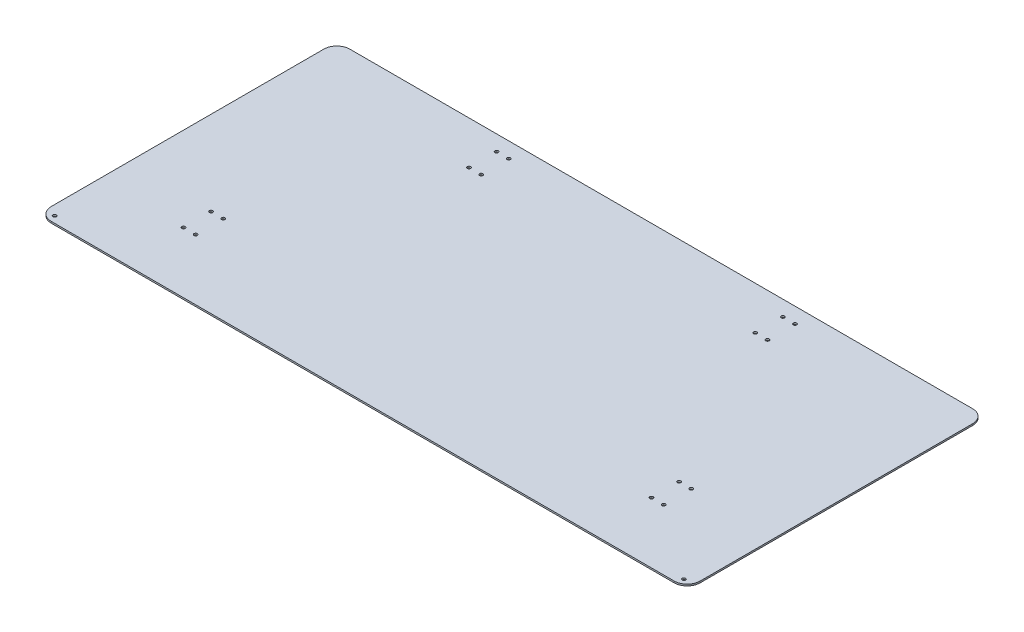
ISO-10303-21;
HEADER;
FILE_DESCRIPTION(('STEP AP214'),'2;1');
FILE_NAME('part.step','',(''),(''),'','','');
FILE_SCHEMA(('AUTOMOTIVE_DESIGN { 1 0 10303 214 1 1 1 1 }'));
ENDSEC;
DATA;
#1=APPLICATION_CONTEXT('core data for automotive mechanical design processes');
#2=APPLICATION_PROTOCOL_DEFINITION('international standard','automotive_design',2000,#1);
#3=PRODUCT_CONTEXT('',#1,'mechanical');
#4=PRODUCT('Part','Part','',(#3));
#5=PRODUCT_RELATED_PRODUCT_CATEGORY('part','',(#4));
#6=PRODUCT_DEFINITION_FORMATION('','',#4);
#7=PRODUCT_DEFINITION_CONTEXT('part definition',#1,'design');
#8=PRODUCT_DEFINITION('design','',#6,#7);
#9=PRODUCT_DEFINITION_SHAPE('','',#8);
#10=(LENGTH_UNIT() NAMED_UNIT(*) SI_UNIT(.MILLI.,.METRE.));
#11=(NAMED_UNIT(*) PLANE_ANGLE_UNIT() SI_UNIT($,.RADIAN.));
#12=(NAMED_UNIT(*) SI_UNIT($,.STERADIAN.) SOLID_ANGLE_UNIT());
#13=UNCERTAINTY_MEASURE_WITH_UNIT(LENGTH_MEASURE(1.E-05),#10,'distance_accuracy_value','');
#14=(GEOMETRIC_REPRESENTATION_CONTEXT(3) GLOBAL_UNCERTAINTY_ASSIGNED_CONTEXT((#13)) GLOBAL_UNIT_ASSIGNED_CONTEXT((#10,
#11,#12)) REPRESENTATION_CONTEXT('',''));
#15=CARTESIAN_POINT('',(0.,0.,0.));
#16=DIRECTION('',(0.,0.,1.));
#17=DIRECTION('',(1.,0.,0.));
#18=AXIS2_PLACEMENT_3D('',#15,#16,#17);
#19=CARTESIAN_POINT('',(0.,3.175,0.));
#20=DIRECTION('',(0.,1.,0.));
#21=DIRECTION('',(0.,0.,1.));
#22=AXIS2_PLACEMENT_3D('',#19,#20,#21);
#23=PLANE('',#22);
#24=CARTESIAN_POINT('',(-469.9,3.175,173.0375));
#25=DIRECTION('',(0.,1.,0.));
#26=DIRECTION('',(0.,0.,1.));
#27=AXIS2_PLACEMENT_3D('',#24,#25,#26);
#28=CIRCLE('',#27,3.302);
#29=CARTESIAN_POINT('',(-469.9,3.175,176.3395));
#30=VERTEX_POINT('',#29);
#31=EDGE_CURVE('E180',#30,#30,#28,.F.);
#32=ORIENTED_EDGE('',*,*,#31,.T.);
#33=EDGE_LOOP('',(#32));
#34=FACE_BOUND('',#33,.T.);
#35=CARTESIAN_POINT('',(615.95,3.175,279.4));
#36=DIRECTION('',(0.,-1.,0.));
#37=DIRECTION('',(0.,0.,-1.));
#38=AXIS2_PLACEMENT_3D('',#35,#36,#37);
#39=CIRCLE('',#38,3.302);
#40=CARTESIAN_POINT('',(615.95,3.175,276.098));
#41=VERTEX_POINT('',#40);
#42=EDGE_CURVE('E183',#41,#41,#39,.T.);
#43=ORIENTED_EDGE('',*,*,#42,.T.);
#44=EDGE_LOOP('',(#43));
#45=FACE_BOUND('',#44,.T.);
#46=CARTESIAN_POINT('',(292.1127,3.175,-261.9375));
#47=DIRECTION('',(0.,-1.,0.));
#48=DIRECTION('',(0.,0.,-1.));
#49=AXIS2_PLACEMENT_3D('',#46,#47,#48);
#50=CIRCLE('',#49,3.302);
#51=CARTESIAN_POINT('',(292.1127,3.175,-265.2395));
#52=VERTEX_POINT('',#51);
#53=EDGE_CURVE('E186',#52,#52,#50,.T.);
#54=ORIENTED_EDGE('',*,*,#53,.T.);
#55=EDGE_LOOP('',(#54));
#56=FACE_BOUND('',#55,.T.);
#57=CARTESIAN_POINT('',(268.3002,3.175,-261.9375));
#58=DIRECTION('',(0.,-1.,0.));
#59=DIRECTION('',(0.,0.,-1.));
#60=AXIS2_PLACEMENT_3D('',#57,#58,#59);
#61=CIRCLE('',#60,3.302);
#62=CARTESIAN_POINT('',(268.3002,3.175,-265.2395));
#63=VERTEX_POINT('',#62);
#64=EDGE_CURVE('E189',#63,#63,#61,.T.);
#65=ORIENTED_EDGE('',*,*,#64,.T.);
#66=EDGE_LOOP('',(#65));
#67=FACE_BOUND('',#66,.T.);
#68=CARTESIAN_POINT('',(268.3002,3.175,-207.9625));
#69=DIRECTION('',(0.,-1.,0.));
#70=DIRECTION('',(0.,0.,-1.));
#71=AXIS2_PLACEMENT_3D('',#68,#69,#70);
#72=CIRCLE('',#71,3.302);
#73=CARTESIAN_POINT('',(268.3002,3.175,-211.2645));
#74=VERTEX_POINT('',#73);
#75=EDGE_CURVE('E192',#74,#74,#72,.T.);
#76=ORIENTED_EDGE('',*,*,#75,.T.);
#77=EDGE_LOOP('',(#76));
#78=FACE_BOUND('',#77,.T.);
#79=CARTESIAN_POINT('',(292.1127,3.175,-207.9625));
#80=DIRECTION('',(0.,-1.,0.));
#81=DIRECTION('',(0.,0.,-1.));
#82=AXIS2_PLACEMENT_3D('',#79,#80,#81);
#83=CIRCLE('',#82,3.302);
#84=CARTESIAN_POINT('',(292.1127,3.175,-211.2645));
#85=VERTEX_POINT('',#84);
#86=EDGE_CURVE('E195',#85,#85,#83,.T.);
#87=ORIENTED_EDGE('',*,*,#86,.T.);
#88=EDGE_LOOP('',(#87));
#89=FACE_BOUND('',#88,.T.);
#90=CARTESIAN_POINT('',(446.0875,3.175,119.0625));
#91=DIRECTION('',(0.,-1.,0.));
#92=DIRECTION('',(0.,0.,-1.));
#93=AXIS2_PLACEMENT_3D('',#90,#91,#92);
#94=CIRCLE('',#93,3.302);
#95=CARTESIAN_POINT('',(446.0875,3.175,115.7605));
#96=VERTEX_POINT('',#95);
#97=EDGE_CURVE('E198',#96,#96,#94,.T.);
#98=ORIENTED_EDGE('',*,*,#97,.T.);
#99=EDGE_LOOP('',(#98));
#100=FACE_BOUND('',#99,.T.);
#101=CARTESIAN_POINT('',(446.0875,3.175,173.0375));
#102=DIRECTION('',(0.,-1.,0.));
#103=DIRECTION('',(0.,0.,-1.));
#104=AXIS2_PLACEMENT_3D('',#101,#102,#103);
#105=CIRCLE('',#104,3.302);
#106=CARTESIAN_POINT('',(446.0875,3.175,169.7355));
#107=VERTEX_POINT('',#106);
#108=EDGE_CURVE('E201',#107,#107,#105,.T.);
#109=ORIENTED_EDGE('',*,*,#108,.T.);
#110=EDGE_LOOP('',(#109));
#111=FACE_BOUND('',#110,.T.);
#112=CARTESIAN_POINT('',(469.9,3.175,119.0625));
#113=DIRECTION('',(0.,-1.,0.));
#114=DIRECTION('',(0.,0.,-1.));
#115=AXIS2_PLACEMENT_3D('',#112,#113,#114);
#116=CIRCLE('',#115,3.302);
#117=CARTESIAN_POINT('',(469.9,3.175,115.7605));
#118=VERTEX_POINT('',#117);
#119=EDGE_CURVE('E204',#118,#118,#116,.T.);
#120=ORIENTED_EDGE('',*,*,#119,.T.);
#121=EDGE_LOOP('',(#120));
#122=FACE_BOUND('',#121,.T.);
#123=CARTESIAN_POINT('',(469.9,3.175,173.0375));
#124=DIRECTION('',(0.,-1.,0.));
#125=DIRECTION('',(0.,0.,-1.));
#126=AXIS2_PLACEMENT_3D('',#123,#124,#125);
#127=CIRCLE('',#126,3.302);
#128=CARTESIAN_POINT('',(469.9,3.175,169.7355));
#129=VERTEX_POINT('',#128);
#130=EDGE_CURVE('E207',#129,#129,#127,.T.);
#131=ORIENTED_EDGE('',*,*,#130,.T.);
#132=EDGE_LOOP('',(#131));
#133=FACE_BOUND('',#132,.T.);
#134=CARTESIAN_POINT('',(-615.95,3.175,279.4));
#135=DIRECTION('',(0.,1.,0.));
#136=DIRECTION('',(0.,0.,1.));
#137=AXIS2_PLACEMENT_3D('',#134,#135,#136);
#138=CIRCLE('',#137,3.302);
#139=CARTESIAN_POINT('',(-615.95,3.175,282.702));
#140=VERTEX_POINT('',#139);
#141=EDGE_CURVE('E210',#140,#140,#138,.F.);
#142=ORIENTED_EDGE('',*,*,#141,.T.);
#143=EDGE_LOOP('',(#142));
#144=FACE_BOUND('',#143,.T.);
#145=CARTESIAN_POINT('',(-292.1127,3.175,-261.9375));
#146=DIRECTION('',(0.,1.,0.));
#147=DIRECTION('',(0.,0.,1.));
#148=AXIS2_PLACEMENT_3D('',#145,#146,#147);
#149=CIRCLE('',#148,3.302);
#150=CARTESIAN_POINT('',(-292.1127,3.175,-258.6355));
#151=VERTEX_POINT('',#150);
#152=EDGE_CURVE('E213',#151,#151,#149,.F.);
#153=ORIENTED_EDGE('',*,*,#152,.T.);
#154=EDGE_LOOP('',(#153));
#155=FACE_BOUND('',#154,.T.);
#156=CARTESIAN_POINT('',(-268.3002,3.175,-261.9375));
#157=DIRECTION('',(0.,1.,0.));
#158=DIRECTION('',(0.,0.,1.));
#159=AXIS2_PLACEMENT_3D('',#156,#157,#158);
#160=CIRCLE('',#159,3.302);
#161=CARTESIAN_POINT('',(-268.3002,3.175,-258.6355));
#162=VERTEX_POINT('',#161);
#163=EDGE_CURVE('E216',#162,#162,#160,.F.);
#164=ORIENTED_EDGE('',*,*,#163,.T.);
#165=EDGE_LOOP('',(#164));
#166=FACE_BOUND('',#165,.T.);
#167=CARTESIAN_POINT('',(-268.3002,3.175,-207.9625));
#168=DIRECTION('',(0.,1.,0.));
#169=DIRECTION('',(0.,0.,1.));
#170=AXIS2_PLACEMENT_3D('',#167,#168,#169);
#171=CIRCLE('',#170,3.302);
#172=CARTESIAN_POINT('',(-268.3002,3.175,-204.6605));
#173=VERTEX_POINT('',#172);
#174=EDGE_CURVE('E219',#173,#173,#171,.F.);
#175=ORIENTED_EDGE('',*,*,#174,.T.);
#176=EDGE_LOOP('',(#175));
#177=FACE_BOUND('',#176,.T.);
#178=CARTESIAN_POINT('',(-292.1127,3.175,-207.9625));
#179=DIRECTION('',(0.,1.,0.));
#180=DIRECTION('',(0.,0.,1.));
#181=AXIS2_PLACEMENT_3D('',#178,#179,#180);
#182=CIRCLE('',#181,3.302);
#183=CARTESIAN_POINT('',(-292.1127,3.175,-204.6605));
#184=VERTEX_POINT('',#183);
#185=EDGE_CURVE('E222',#184,#184,#182,.F.);
#186=ORIENTED_EDGE('',*,*,#185,.T.);
#187=EDGE_LOOP('',(#186));
#188=FACE_BOUND('',#187,.T.);
#189=CARTESIAN_POINT('',(-446.0875,3.175,119.0625));
#190=DIRECTION('',(0.,1.,0.));
#191=DIRECTION('',(0.,0.,1.));
#192=AXIS2_PLACEMENT_3D('',#189,#190,#191);
#193=CIRCLE('',#192,3.302);
#194=CARTESIAN_POINT('',(-446.0875,3.175,122.3645));
#195=VERTEX_POINT('',#194);
#196=EDGE_CURVE('E225',#195,#195,#193,.F.);
#197=ORIENTED_EDGE('',*,*,#196,.T.);
#198=EDGE_LOOP('',(#197));
#199=FACE_BOUND('',#198,.T.);
#200=CARTESIAN_POINT('',(-446.0875,3.175,173.0375));
#201=DIRECTION('',(0.,1.,0.));
#202=DIRECTION('',(0.,0.,1.));
#203=AXIS2_PLACEMENT_3D('',#200,#201,#202);
#204=CIRCLE('',#203,3.302);
#205=CARTESIAN_POINT('',(-446.0875,3.175,176.3395));
#206=VERTEX_POINT('',#205);
#207=EDGE_CURVE('E228',#206,#206,#204,.F.);
#208=ORIENTED_EDGE('',*,*,#207,.T.);
#209=EDGE_LOOP('',(#208));
#210=FACE_BOUND('',#209,.T.);
#211=CARTESIAN_POINT('',(-469.9,3.175,119.0625));
#212=DIRECTION('',(0.,1.,0.));
#213=DIRECTION('',(0.,0.,1.));
#214=AXIS2_PLACEMENT_3D('',#211,#212,#213);
#215=CIRCLE('',#214,3.302);
#216=CARTESIAN_POINT('',(-469.9,3.175,122.3645));
#217=VERTEX_POINT('',#216);
#218=EDGE_CURVE('E105',#217,#217,#215,.F.);
#219=ORIENTED_EDGE('',*,*,#218,.T.);
#220=EDGE_LOOP('',(#219));
#221=FACE_BOUND('',#220,.T.);
#222=DIRECTION('',(0.,0.,-1.));
#223=VECTOR('',#222,1.);
#224=CARTESIAN_POINT('',(-635.,3.175,0.));
#225=LINE('',#224,#223);
#226=CARTESIAN_POINT('',(-635.,3.175,-266.7));
#227=VERTEX_POINT('',#226);
#228=CARTESIAN_POINT('',(-635.,3.175,266.7));
#229=VERTEX_POINT('',#228);
#230=EDGE_CURVE('E84',#227,#229,#225,.F.);
#231=ORIENTED_EDGE('',*,*,#230,.T.);
#232=CARTESIAN_POINT('',(-609.6,3.175,266.7));
#233=DIRECTION('',(0.,-1.,0.));
#234=DIRECTION('',(0.,0.,-1.));
#235=AXIS2_PLACEMENT_3D('',#232,#233,#234);
#236=CIRCLE('',#235,25.4);
#237=CARTESIAN_POINT('',(-609.6,3.175,292.1));
#238=VERTEX_POINT('',#237);
#239=EDGE_CURVE('E20',#238,#229,#236,.T.);
#240=ORIENTED_EDGE('',*,*,#239,.F.);
#241=DIRECTION('',(-1.,0.,0.));
#242=VECTOR('',#241,1.);
#243=CARTESIAN_POINT('',(0.,3.175,292.1));
#244=LINE('',#243,#242);
#245=CARTESIAN_POINT('',(609.6,3.175,292.1));
#246=VERTEX_POINT('',#245);
#247=EDGE_CURVE('E82',#238,#246,#244,.F.);
#248=ORIENTED_EDGE('',*,*,#247,.T.);
#249=CARTESIAN_POINT('',(609.6,3.175,266.7));
#250=DIRECTION('',(0.,-1.,0.));
#251=DIRECTION('',(0.,0.,-1.));
#252=AXIS2_PLACEMENT_3D('',#249,#250,#251);
#253=CIRCLE('',#252,25.4);
#254=CARTESIAN_POINT('',(635.,3.175,266.7));
#255=VERTEX_POINT('',#254);
#256=EDGE_CURVE('E95',#255,#246,#253,.T.);
#257=ORIENTED_EDGE('',*,*,#256,.F.);
#258=DIRECTION('',(0.,0.,1.));
#259=VECTOR('',#258,1.);
#260=CARTESIAN_POINT('',(635.,3.175,0.));
#261=LINE('',#260,#259);
#262=CARTESIAN_POINT('',(635.,3.175,-266.7));
#263=VERTEX_POINT('',#262);
#264=EDGE_CURVE('E111',#255,#263,#261,.F.);
#265=ORIENTED_EDGE('',*,*,#264,.T.);
#266=CARTESIAN_POINT('',(609.6,3.175,-266.7));
#267=DIRECTION('',(0.,-1.,0.));
#268=DIRECTION('',(0.,0.,-1.));
#269=AXIS2_PLACEMENT_3D('',#266,#267,#268);
#270=CIRCLE('',#269,25.4);
#271=CARTESIAN_POINT('',(609.6,3.175,-292.1));
#272=VERTEX_POINT('',#271);
#273=EDGE_CURVE('E113',#272,#263,#270,.T.);
#274=ORIENTED_EDGE('',*,*,#273,.F.);
#275=DIRECTION('',(1.,0.,0.));
#276=VECTOR('',#275,1.);
#277=CARTESIAN_POINT('',(0.,3.175,-292.1));
#278=LINE('',#277,#276);
#279=CARTESIAN_POINT('',(-609.6,3.175,-292.1));
#280=VERTEX_POINT('',#279);
#281=EDGE_CURVE('E106',#272,#280,#278,.F.);
#282=ORIENTED_EDGE('',*,*,#281,.T.);
#283=CARTESIAN_POINT('',(-609.6,3.175,-266.7));
#284=DIRECTION('',(0.,-1.,0.));
#285=DIRECTION('',(0.,0.,-1.));
#286=AXIS2_PLACEMENT_3D('',#283,#284,#285);
#287=CIRCLE('',#286,25.4);
#288=EDGE_CURVE('E109',#227,#280,#287,.T.);
#289=ORIENTED_EDGE('',*,*,#288,.F.);
#290=EDGE_LOOP('',(#231,#240,#248,#257,#265,#274,#282,#289));
#291=FACE_BOUND('',#290,.T.);
#292=ADVANCED_FACE('F17',(#34,#45,#56,#67,#78,#89,#100,#111,#122,#133,#144,#155,#166,#177,#188,
#199,#210,#221,#291),#23,.T.);
#293=CARTESIAN_POINT('',(-609.6,34.03727,266.7));
#294=DIRECTION('',(0.,-1.,0.));
#295=DIRECTION('',(0.,0.,-1.));
#296=AXIS2_PLACEMENT_3D('',#293,#294,#295);
#297=CYLINDRICAL_SURFACE('',#296,25.4);
#298=DIRECTION('',(0.,1.,0.));
#299=VECTOR('',#298,1.);
#300=CARTESIAN_POINT('',(-635.,1.5875,266.7));
#301=LINE('',#300,#299);
#302=CARTESIAN_POINT('',(-635.,0.,266.7));
#303=VERTEX_POINT('',#302);
#304=EDGE_CURVE('E244',#229,#303,#301,.F.);
#305=ORIENTED_EDGE('',*,*,#304,.T.);
#306=CARTESIAN_POINT('',(-609.6,0.,266.7));
#307=DIRECTION('',(0.,-1.,0.));
#308=DIRECTION('',(0.,0.,-1.));
#309=AXIS2_PLACEMENT_3D('',#306,#307,#308);
#310=CIRCLE('',#309,25.4);
#311=CARTESIAN_POINT('',(-609.6,0.,292.1));
#312=VERTEX_POINT('',#311);
#313=EDGE_CURVE('E99',#303,#312,#310,.F.);
#314=ORIENTED_EDGE('',*,*,#313,.T.);
#315=DIRECTION('',(0.,1.,0.));
#316=VECTOR('',#315,1.);
#317=CARTESIAN_POINT('',(-609.6,1.5875,292.1));
#318=LINE('',#317,#316);
#319=EDGE_CURVE('E89',#312,#238,#318,.T.);
#320=ORIENTED_EDGE('',*,*,#319,.T.);
#321=ORIENTED_EDGE('',*,*,#239,.T.);
#322=EDGE_LOOP('',(#305,#314,#320,#321));
#323=FACE_BOUND('',#322,.T.);
#324=ADVANCED_FACE('F98',(#323),#297,.T.);
#325=CARTESIAN_POINT('',(0.,1.5875,292.1));
#326=DIRECTION('',(0.,0.,-1.));
#327=DIRECTION('',(-1.,0.,0.));
#328=AXIS2_PLACEMENT_3D('',#325,#326,#327);
#329=PLANE('',#328);
#330=DIRECTION('',(0.,-1.,0.));
#331=VECTOR('',#330,1.);
#332=CARTESIAN_POINT('',(609.6,34.03727,292.1));
#333=LINE('',#332,#331);
#334=CARTESIAN_POINT('',(609.6,0.,292.1));
#335=VERTEX_POINT('',#334);
#336=EDGE_CURVE('E94',#246,#335,#333,.T.);
#337=ORIENTED_EDGE('',*,*,#336,.F.);
#338=ORIENTED_EDGE('',*,*,#247,.F.);
#339=ORIENTED_EDGE('',*,*,#319,.F.);
#340=DIRECTION('',(1.,0.,0.));
#341=VECTOR('',#340,1.);
#342=CARTESIAN_POINT('',(0.,0.,292.1));
#343=LINE('',#342,#341);
#344=EDGE_CURVE('E178',#312,#335,#343,.T.);
#345=ORIENTED_EDGE('',*,*,#344,.T.);
#346=EDGE_LOOP('',(#337,#338,#339,#345));
#347=FACE_BOUND('',#346,.T.);
#348=ADVANCED_FACE('F91',(#347),#329,.F.);
#349=CARTESIAN_POINT('',(609.6,34.03727,266.7));
#350=DIRECTION('',(0.,-1.,0.));
#351=DIRECTION('',(0.,0.,-1.));
#352=AXIS2_PLACEMENT_3D('',#349,#350,#351);
#353=CYLINDRICAL_SURFACE('',#352,25.4);
#354=ORIENTED_EDGE('',*,*,#336,.T.);
#355=CARTESIAN_POINT('',(609.6,0.,266.7));
#356=DIRECTION('',(0.,-1.,0.));
#357=DIRECTION('',(0.,0.,-1.));
#358=AXIS2_PLACEMENT_3D('',#355,#356,#357);
#359=CIRCLE('',#358,25.4);
#360=CARTESIAN_POINT('',(635.,0.,266.7));
#361=VERTEX_POINT('',#360);
#362=EDGE_CURVE('E175',#335,#361,#359,.F.);
#363=ORIENTED_EDGE('',*,*,#362,.T.);
#364=DIRECTION('',(0.,1.,0.));
#365=VECTOR('',#364,1.);
#366=CARTESIAN_POINT('',(635.,1.5875,266.7));
#367=LINE('',#366,#365);
#368=EDGE_CURVE('E114',#361,#255,#367,.T.);
#369=ORIENTED_EDGE('',*,*,#368,.T.);
#370=ORIENTED_EDGE('',*,*,#256,.T.);
#371=EDGE_LOOP('',(#354,#363,#369,#370));
#372=FACE_BOUND('',#371,.T.);
#373=ADVANCED_FACE('F271',(#372),#353,.T.);
#374=CARTESIAN_POINT('',(635.,1.5875,0.));
#375=DIRECTION('',(-1.,0.,0.));
#376=DIRECTION('',(0.,0.,1.));
#377=AXIS2_PLACEMENT_3D('',#374,#375,#376);
#378=PLANE('',#377);
#379=DIRECTION('',(0.,-1.,0.));
#380=VECTOR('',#379,1.);
#381=CARTESIAN_POINT('',(635.,34.03727,-266.7));
#382=LINE('',#381,#380);
#383=CARTESIAN_POINT('',(635.,0.,-266.7));
#384=VERTEX_POINT('',#383);
#385=EDGE_CURVE('E235',#263,#384,#382,.T.);
#386=ORIENTED_EDGE('',*,*,#385,.F.);
#387=ORIENTED_EDGE('',*,*,#264,.F.);
#388=ORIENTED_EDGE('',*,*,#368,.F.);
#389=DIRECTION('',(0.,0.,1.));
#390=VECTOR('',#389,1.);
#391=CARTESIAN_POINT('',(635.,0.,0.));
#392=LINE('',#391,#390);
#393=EDGE_CURVE('E174',#361,#384,#392,.F.);
#394=ORIENTED_EDGE('',*,*,#393,.T.);
#395=EDGE_LOOP('',(#386,#387,#388,#394));
#396=FACE_BOUND('',#395,.T.);
#397=ADVANCED_FACE('F270',(#396),#378,.F.);
#398=CARTESIAN_POINT('',(609.6,34.03727,-266.7));
#399=DIRECTION('',(0.,-1.,0.));
#400=DIRECTION('',(0.,0.,-1.));
#401=AXIS2_PLACEMENT_3D('',#398,#399,#400);
#402=CYLINDRICAL_SURFACE('',#401,25.4);
#403=ORIENTED_EDGE('',*,*,#385,.T.);
#404=CARTESIAN_POINT('',(609.6,0.,-266.7));
#405=DIRECTION('',(0.,-1.,0.));
#406=DIRECTION('',(0.,0.,-1.));
#407=AXIS2_PLACEMENT_3D('',#404,#405,#406);
#408=CIRCLE('',#407,25.4);
#409=CARTESIAN_POINT('',(609.6,0.,-292.1));
#410=VERTEX_POINT('',#409);
#411=EDGE_CURVE('E171',#384,#410,#408,.F.);
#412=ORIENTED_EDGE('',*,*,#411,.T.);
#413=DIRECTION('',(0.,1.,0.));
#414=VECTOR('',#413,1.);
#415=CARTESIAN_POINT('',(609.6,1.5875,-292.1));
#416=LINE('',#415,#414);
#417=EDGE_CURVE('E110',#410,#272,#416,.T.);
#418=ORIENTED_EDGE('',*,*,#417,.T.);
#419=ORIENTED_EDGE('',*,*,#273,.T.);
#420=EDGE_LOOP('',(#403,#412,#418,#419));
#421=FACE_BOUND('',#420,.T.);
#422=ADVANCED_FACE('F266',(#421),#402,.T.);
#423=CARTESIAN_POINT('',(0.,1.5875,-292.1));
#424=DIRECTION('',(0.,0.,1.));
#425=DIRECTION('',(1.,0.,0.));
#426=AXIS2_PLACEMENT_3D('',#423,#424,#425);
#427=PLANE('',#426);
#428=ORIENTED_EDGE('',*,*,#417,.F.);
#429=DIRECTION('',(1.,0.,0.));
#430=VECTOR('',#429,1.);
#431=CARTESIAN_POINT('',(0.,0.,-292.1));
#432=LINE('',#431,#430);
#433=CARTESIAN_POINT('',(-609.6,0.,-292.1));
#434=VERTEX_POINT('',#433);
#435=EDGE_CURVE('E170',#410,#434,#432,.F.);
#436=ORIENTED_EDGE('',*,*,#435,.T.);
#437=DIRECTION('',(0.,-1.,0.));
#438=VECTOR('',#437,1.);
#439=CARTESIAN_POINT('',(-609.6,34.03727,-292.1));
#440=LINE('',#439,#438);
#441=EDGE_CURVE('E234',#280,#434,#440,.T.);
#442=ORIENTED_EDGE('',*,*,#441,.F.);
#443=ORIENTED_EDGE('',*,*,#281,.F.);
#444=EDGE_LOOP('',(#428,#436,#442,#443));
#445=FACE_BOUND('',#444,.T.);
#446=ADVANCED_FACE('F262',(#445),#427,.F.);
#447=CARTESIAN_POINT('',(-609.6,34.03727,-266.7));
#448=DIRECTION('',(0.,-1.,0.));
#449=DIRECTION('',(0.,0.,-1.));
#450=AXIS2_PLACEMENT_3D('',#447,#448,#449);
#451=CYLINDRICAL_SURFACE('',#450,25.4);
#452=ORIENTED_EDGE('',*,*,#441,.T.);
#453=CARTESIAN_POINT('',(-609.6,0.,-266.7));
#454=DIRECTION('',(0.,-1.,0.));
#455=DIRECTION('',(0.,0.,-1.));
#456=AXIS2_PLACEMENT_3D('',#453,#454,#455);
#457=CIRCLE('',#456,25.4);
#458=CARTESIAN_POINT('',(-635.,0.,-266.7));
#459=VERTEX_POINT('',#458);
#460=EDGE_CURVE('E167',#434,#459,#457,.F.);
#461=ORIENTED_EDGE('',*,*,#460,.T.);
#462=DIRECTION('',(0.,1.,0.));
#463=VECTOR('',#462,1.);
#464=CARTESIAN_POINT('',(-635.,1.5875,-266.7));
#465=LINE('',#464,#463);
#466=EDGE_CURVE('E35',#459,#227,#465,.T.);
#467=ORIENTED_EDGE('',*,*,#466,.T.);
#468=ORIENTED_EDGE('',*,*,#288,.T.);
#469=EDGE_LOOP('',(#452,#461,#467,#468));
#470=FACE_BOUND('',#469,.T.);
#471=ADVANCED_FACE('F258',(#470),#451,.T.);
#472=CARTESIAN_POINT('',(-635.,1.5875,0.));
#473=DIRECTION('',(1.,0.,0.));
#474=DIRECTION('',(0.,0.,-1.));
#475=AXIS2_PLACEMENT_3D('',#472,#473,#474);
#476=PLANE('',#475);
#477=ORIENTED_EDGE('',*,*,#466,.F.);
#478=DIRECTION('',(0.,0.,1.));
#479=VECTOR('',#478,1.);
#480=CARTESIAN_POINT('',(-635.,0.,0.));
#481=LINE('',#480,#479);
#482=EDGE_CURVE('E166',#459,#303,#481,.T.);
#483=ORIENTED_EDGE('',*,*,#482,.T.);
#484=ORIENTED_EDGE('',*,*,#304,.F.);
#485=ORIENTED_EDGE('',*,*,#230,.F.);
#486=EDGE_LOOP('',(#477,#483,#484,#485));
#487=FACE_BOUND('',#486,.T.);
#488=ADVANCED_FACE('F252',(#487),#476,.F.);
#489=CARTESIAN_POINT('',(-469.9,-1.62651457070629,119.0625));
#490=DIRECTION('',(0.,1.,0.));
#491=DIRECTION('',(0.,0.,1.));
#492=AXIS2_PLACEMENT_3D('',#489,#490,#491);
#493=CYLINDRICAL_SURFACE('',#492,3.302);
#494=ORIENTED_EDGE('',*,*,#218,.F.);
#495=EDGE_LOOP('',(#494));
#496=FACE_BOUND('',#495,.T.);
#497=CARTESIAN_POINT('',(-469.9,0.,119.0625));
#498=DIRECTION('',(0.,1.,0.));
#499=DIRECTION('',(0.,0.,1.));
#500=AXIS2_PLACEMENT_3D('',#497,#498,#499);
#501=CIRCLE('',#500,3.302);
#502=CARTESIAN_POINT('',(-469.9,0.,122.3645));
#503=VERTEX_POINT('',#502);
#504=EDGE_CURVE('E163',#503,#503,#501,.F.);
#505=ORIENTED_EDGE('',*,*,#504,.T.);
#506=EDGE_LOOP('',(#505));
#507=FACE_BOUND('',#506,.T.);
#508=ADVANCED_FACE('F356',(#496,#507),#493,.F.);
#509=CARTESIAN_POINT('',(-446.0875,-1.62651457070629,173.0375));
#510=DIRECTION('',(0.,1.,0.));
#511=DIRECTION('',(0.,0.,1.));
#512=AXIS2_PLACEMENT_3D('',#509,#510,#511);
#513=CYLINDRICAL_SURFACE('',#512,3.302);
#514=ORIENTED_EDGE('',*,*,#207,.F.);
#515=EDGE_LOOP('',(#514));
#516=FACE_BOUND('',#515,.T.);
#517=CARTESIAN_POINT('',(-446.0875,0.,173.0375));
#518=DIRECTION('',(0.,1.,0.));
#519=DIRECTION('',(0.,0.,1.));
#520=AXIS2_PLACEMENT_3D('',#517,#518,#519);
#521=CIRCLE('',#520,3.302);
#522=CARTESIAN_POINT('',(-446.0875,0.,176.3395));
#523=VERTEX_POINT('',#522);
#524=EDGE_CURVE('E160',#523,#523,#521,.F.);
#525=ORIENTED_EDGE('',*,*,#524,.T.);
#526=EDGE_LOOP('',(#525));
#527=FACE_BOUND('',#526,.T.);
#528=ADVANCED_FACE('F352',(#516,#527),#513,.F.);
#529=CARTESIAN_POINT('',(-446.0875,-1.62651457070629,119.0625));
#530=DIRECTION('',(0.,1.,0.));
#531=DIRECTION('',(0.,0.,1.));
#532=AXIS2_PLACEMENT_3D('',#529,#530,#531);
#533=CYLINDRICAL_SURFACE('',#532,3.302);
#534=ORIENTED_EDGE('',*,*,#196,.F.);
#535=EDGE_LOOP('',(#534));
#536=FACE_BOUND('',#535,.T.);
#537=CARTESIAN_POINT('',(-446.0875,0.,119.0625));
#538=DIRECTION('',(0.,1.,0.));
#539=DIRECTION('',(0.,0.,1.));
#540=AXIS2_PLACEMENT_3D('',#537,#538,#539);
#541=CIRCLE('',#540,3.302);
#542=CARTESIAN_POINT('',(-446.0875,0.,122.3645));
#543=VERTEX_POINT('',#542);
#544=EDGE_CURVE('E157',#543,#543,#541,.F.);
#545=ORIENTED_EDGE('',*,*,#544,.T.);
#546=EDGE_LOOP('',(#545));
#547=FACE_BOUND('',#546,.T.);
#548=ADVANCED_FACE('F348',(#536,#547),#533,.F.);
#549=CARTESIAN_POINT('',(-292.1127,-1.62651457070629,-207.9625));
#550=DIRECTION('',(0.,1.,0.));
#551=DIRECTION('',(0.,0.,1.));
#552=AXIS2_PLACEMENT_3D('',#549,#550,#551);
#553=CYLINDRICAL_SURFACE('',#552,3.302);
#554=ORIENTED_EDGE('',*,*,#185,.F.);
#555=EDGE_LOOP('',(#554));
#556=FACE_BOUND('',#555,.T.);
#557=CARTESIAN_POINT('',(-292.1127,0.,-207.9625));
#558=DIRECTION('',(0.,1.,0.));
#559=DIRECTION('',(0.,0.,1.));
#560=AXIS2_PLACEMENT_3D('',#557,#558,#559);
#561=CIRCLE('',#560,3.302);
#562=CARTESIAN_POINT('',(-292.1127,0.,-204.6605));
#563=VERTEX_POINT('',#562);
#564=EDGE_CURVE('E154',#563,#563,#561,.F.);
#565=ORIENTED_EDGE('',*,*,#564,.T.);
#566=EDGE_LOOP('',(#565));
#567=FACE_BOUND('',#566,.T.);
#568=ADVANCED_FACE('F344',(#556,#567),#553,.F.);
#569=CARTESIAN_POINT('',(-268.3002,-1.62651457070629,-207.9625));
#570=DIRECTION('',(0.,1.,0.));
#571=DIRECTION('',(0.,0.,1.));
#572=AXIS2_PLACEMENT_3D('',#569,#570,#571);
#573=CYLINDRICAL_SURFACE('',#572,3.302);
#574=ORIENTED_EDGE('',*,*,#174,.F.);
#575=EDGE_LOOP('',(#574));
#576=FACE_BOUND('',#575,.T.);
#577=CARTESIAN_POINT('',(-268.3002,0.,-207.9625));
#578=DIRECTION('',(0.,1.,0.));
#579=DIRECTION('',(0.,0.,1.));
#580=AXIS2_PLACEMENT_3D('',#577,#578,#579);
#581=CIRCLE('',#580,3.302);
#582=CARTESIAN_POINT('',(-268.3002,0.,-204.6605));
#583=VERTEX_POINT('',#582);
#584=EDGE_CURVE('E151',#583,#583,#581,.F.);
#585=ORIENTED_EDGE('',*,*,#584,.T.);
#586=EDGE_LOOP('',(#585));
#587=FACE_BOUND('',#586,.T.);
#588=ADVANCED_FACE('F340',(#576,#587),#573,.F.);
#589=CARTESIAN_POINT('',(-268.3002,-1.62651457070629,-261.9375));
#590=DIRECTION('',(0.,1.,0.));
#591=DIRECTION('',(0.,0.,1.));
#592=AXIS2_PLACEMENT_3D('',#589,#590,#591);
#593=CYLINDRICAL_SURFACE('',#592,3.302);
#594=ORIENTED_EDGE('',*,*,#163,.F.);
#595=EDGE_LOOP('',(#594));
#596=FACE_BOUND('',#595,.T.);
#597=CARTESIAN_POINT('',(-268.3002,0.,-261.9375));
#598=DIRECTION('',(0.,1.,0.));
#599=DIRECTION('',(0.,0.,1.));
#600=AXIS2_PLACEMENT_3D('',#597,#598,#599);
#601=CIRCLE('',#600,3.302);
#602=CARTESIAN_POINT('',(-268.3002,0.,-258.6355));
#603=VERTEX_POINT('',#602);
#604=EDGE_CURVE('E148',#603,#603,#601,.F.);
#605=ORIENTED_EDGE('',*,*,#604,.T.);
#606=EDGE_LOOP('',(#605));
#607=FACE_BOUND('',#606,.T.);
#608=ADVANCED_FACE('F336',(#596,#607),#593,.F.);
#609=CARTESIAN_POINT('',(-292.1127,-1.62651457070629,-261.9375));
#610=DIRECTION('',(0.,1.,0.));
#611=DIRECTION('',(0.,0.,1.));
#612=AXIS2_PLACEMENT_3D('',#609,#610,#611);
#613=CYLINDRICAL_SURFACE('',#612,3.302);
#614=ORIENTED_EDGE('',*,*,#152,.F.);
#615=EDGE_LOOP('',(#614));
#616=FACE_BOUND('',#615,.T.);
#617=CARTESIAN_POINT('',(-292.1127,0.,-261.9375));
#618=DIRECTION('',(0.,1.,0.));
#619=DIRECTION('',(0.,0.,1.));
#620=AXIS2_PLACEMENT_3D('',#617,#618,#619);
#621=CIRCLE('',#620,3.302);
#622=CARTESIAN_POINT('',(-292.1127,0.,-258.6355));
#623=VERTEX_POINT('',#622);
#624=EDGE_CURVE('E145',#623,#623,#621,.F.);
#625=ORIENTED_EDGE('',*,*,#624,.T.);
#626=EDGE_LOOP('',(#625));
#627=FACE_BOUND('',#626,.T.);
#628=ADVANCED_FACE('F332',(#616,#627),#613,.F.);
#629=CARTESIAN_POINT('',(-615.95,-1.62651457070629,279.4));
#630=DIRECTION('',(0.,1.,0.));
#631=DIRECTION('',(0.,0.,1.));
#632=AXIS2_PLACEMENT_3D('',#629,#630,#631);
#633=CYLINDRICAL_SURFACE('',#632,3.302);
#634=ORIENTED_EDGE('',*,*,#141,.F.);
#635=EDGE_LOOP('',(#634));
#636=FACE_BOUND('',#635,.T.);
#637=CARTESIAN_POINT('',(-615.95,0.,279.4));
#638=DIRECTION('',(0.,1.,0.));
#639=DIRECTION('',(0.,0.,1.));
#640=AXIS2_PLACEMENT_3D('',#637,#638,#639);
#641=CIRCLE('',#640,3.302);
#642=CARTESIAN_POINT('',(-615.95,0.,282.702));
#643=VERTEX_POINT('',#642);
#644=EDGE_CURVE('E142',#643,#643,#641,.F.);
#645=ORIENTED_EDGE('',*,*,#644,.T.);
#646=EDGE_LOOP('',(#645));
#647=FACE_BOUND('',#646,.T.);
#648=ADVANCED_FACE('F328',(#636,#647),#633,.F.);
#649=CARTESIAN_POINT('',(469.9,-1.62651457070629,173.0375));
#650=DIRECTION('',(0.,-1.,0.));
#651=DIRECTION('',(0.,0.,-1.));
#652=AXIS2_PLACEMENT_3D('',#649,#650,#651);
#653=CYLINDRICAL_SURFACE('',#652,3.302);
#654=CARTESIAN_POINT('',(469.9,0.,173.0375));
#655=DIRECTION('',(0.,-1.,0.));
#656=DIRECTION('',(0.,0.,-1.));
#657=AXIS2_PLACEMENT_3D('',#654,#655,#656);
#658=CIRCLE('',#657,3.302);
#659=CARTESIAN_POINT('',(469.9,0.,169.7355));
#660=VERTEX_POINT('',#659);
#661=EDGE_CURVE('E139',#660,#660,#658,.T.);
#662=ORIENTED_EDGE('',*,*,#661,.T.);
#663=EDGE_LOOP('',(#662));
#664=FACE_BOUND('',#663,.T.);
#665=ORIENTED_EDGE('',*,*,#130,.F.);
#666=EDGE_LOOP('',(#665));
#667=FACE_BOUND('',#666,.T.);
#668=ADVANCED_FACE('F324',(#664,#667),#653,.F.);
#669=CARTESIAN_POINT('',(469.9,-1.62651457070629,119.0625));
#670=DIRECTION('',(0.,-1.,0.));
#671=DIRECTION('',(0.,0.,-1.));
#672=AXIS2_PLACEMENT_3D('',#669,#670,#671);
#673=CYLINDRICAL_SURFACE('',#672,3.302);
#674=CARTESIAN_POINT('',(469.9,0.,119.0625));
#675=DIRECTION('',(0.,-1.,0.));
#676=DIRECTION('',(0.,0.,-1.));
#677=AXIS2_PLACEMENT_3D('',#674,#675,#676);
#678=CIRCLE('',#677,3.302);
#679=CARTESIAN_POINT('',(469.9,0.,115.7605));
#680=VERTEX_POINT('',#679);
#681=EDGE_CURVE('E136',#680,#680,#678,.T.);
#682=ORIENTED_EDGE('',*,*,#681,.T.);
#683=EDGE_LOOP('',(#682));
#684=FACE_BOUND('',#683,.T.);
#685=ORIENTED_EDGE('',*,*,#119,.F.);
#686=EDGE_LOOP('',(#685));
#687=FACE_BOUND('',#686,.T.);
#688=ADVANCED_FACE('F320',(#684,#687),#673,.F.);
#689=CARTESIAN_POINT('',(446.0875,-1.62651457070629,173.0375));
#690=DIRECTION('',(0.,-1.,0.));
#691=DIRECTION('',(0.,0.,-1.));
#692=AXIS2_PLACEMENT_3D('',#689,#690,#691);
#693=CYLINDRICAL_SURFACE('',#692,3.302);
#694=CARTESIAN_POINT('',(446.0875,0.,173.0375));
#695=DIRECTION('',(0.,-1.,0.));
#696=DIRECTION('',(0.,0.,-1.));
#697=AXIS2_PLACEMENT_3D('',#694,#695,#696);
#698=CIRCLE('',#697,3.302);
#699=CARTESIAN_POINT('',(446.0875,0.,169.7355));
#700=VERTEX_POINT('',#699);
#701=EDGE_CURVE('E133',#700,#700,#698,.T.);
#702=ORIENTED_EDGE('',*,*,#701,.T.);
#703=EDGE_LOOP('',(#702));
#704=FACE_BOUND('',#703,.T.);
#705=ORIENTED_EDGE('',*,*,#108,.F.);
#706=EDGE_LOOP('',(#705));
#707=FACE_BOUND('',#706,.T.);
#708=ADVANCED_FACE('F316',(#704,#707),#693,.F.);
#709=CARTESIAN_POINT('',(446.0875,-1.62651457070629,119.0625));
#710=DIRECTION('',(0.,-1.,0.));
#711=DIRECTION('',(0.,0.,-1.));
#712=AXIS2_PLACEMENT_3D('',#709,#710,#711);
#713=CYLINDRICAL_SURFACE('',#712,3.302);
#714=CARTESIAN_POINT('',(446.0875,0.,119.0625));
#715=DIRECTION('',(0.,-1.,0.));
#716=DIRECTION('',(0.,0.,-1.));
#717=AXIS2_PLACEMENT_3D('',#714,#715,#716);
#718=CIRCLE('',#717,3.302);
#719=CARTESIAN_POINT('',(446.0875,0.,115.7605));
#720=VERTEX_POINT('',#719);
#721=EDGE_CURVE('E130',#720,#720,#718,.T.);
#722=ORIENTED_EDGE('',*,*,#721,.T.);
#723=EDGE_LOOP('',(#722));
#724=FACE_BOUND('',#723,.T.);
#725=ORIENTED_EDGE('',*,*,#97,.F.);
#726=EDGE_LOOP('',(#725));
#727=FACE_BOUND('',#726,.T.);
#728=ADVANCED_FACE('F312',(#724,#727),#713,.F.);
#729=CARTESIAN_POINT('',(292.1127,-1.62651457070629,-207.9625));
#730=DIRECTION('',(0.,-1.,0.));
#731=DIRECTION('',(0.,0.,-1.));
#732=AXIS2_PLACEMENT_3D('',#729,#730,#731);
#733=CYLINDRICAL_SURFACE('',#732,3.302);
#734=CARTESIAN_POINT('',(292.1127,0.,-207.9625));
#735=DIRECTION('',(0.,-1.,0.));
#736=DIRECTION('',(0.,0.,-1.));
#737=AXIS2_PLACEMENT_3D('',#734,#735,#736);
#738=CIRCLE('',#737,3.302);
#739=CARTESIAN_POINT('',(292.1127,0.,-211.2645));
#740=VERTEX_POINT('',#739);
#741=EDGE_CURVE('E127',#740,#740,#738,.T.);
#742=ORIENTED_EDGE('',*,*,#741,.T.);
#743=EDGE_LOOP('',(#742));
#744=FACE_BOUND('',#743,.T.);
#745=ORIENTED_EDGE('',*,*,#86,.F.);
#746=EDGE_LOOP('',(#745));
#747=FACE_BOUND('',#746,.T.);
#748=ADVANCED_FACE('F308',(#744,#747),#733,.F.);
#749=CARTESIAN_POINT('',(268.3002,-1.62651457070629,-207.9625));
#750=DIRECTION('',(0.,-1.,0.));
#751=DIRECTION('',(0.,0.,-1.));
#752=AXIS2_PLACEMENT_3D('',#749,#750,#751);
#753=CYLINDRICAL_SURFACE('',#752,3.302);
#754=CARTESIAN_POINT('',(268.3002,0.,-207.9625));
#755=DIRECTION('',(0.,-1.,0.));
#756=DIRECTION('',(0.,0.,-1.));
#757=AXIS2_PLACEMENT_3D('',#754,#755,#756);
#758=CIRCLE('',#757,3.302);
#759=CARTESIAN_POINT('',(268.3002,0.,-211.2645));
#760=VERTEX_POINT('',#759);
#761=EDGE_CURVE('E124',#760,#760,#758,.T.);
#762=ORIENTED_EDGE('',*,*,#761,.T.);
#763=EDGE_LOOP('',(#762));
#764=FACE_BOUND('',#763,.T.);
#765=ORIENTED_EDGE('',*,*,#75,.F.);
#766=EDGE_LOOP('',(#765));
#767=FACE_BOUND('',#766,.T.);
#768=ADVANCED_FACE('F304',(#764,#767),#753,.F.);
#769=CARTESIAN_POINT('',(268.3002,-1.62651457070629,-261.9375));
#770=DIRECTION('',(0.,-1.,0.));
#771=DIRECTION('',(0.,0.,-1.));
#772=AXIS2_PLACEMENT_3D('',#769,#770,#771);
#773=CYLINDRICAL_SURFACE('',#772,3.302);
#774=CARTESIAN_POINT('',(268.3002,0.,-261.9375));
#775=DIRECTION('',(0.,-1.,0.));
#776=DIRECTION('',(0.,0.,-1.));
#777=AXIS2_PLACEMENT_3D('',#774,#775,#776);
#778=CIRCLE('',#777,3.302);
#779=CARTESIAN_POINT('',(268.3002,0.,-265.2395));
#780=VERTEX_POINT('',#779);
#781=EDGE_CURVE('E121',#780,#780,#778,.T.);
#782=ORIENTED_EDGE('',*,*,#781,.T.);
#783=EDGE_LOOP('',(#782));
#784=FACE_BOUND('',#783,.T.);
#785=ORIENTED_EDGE('',*,*,#64,.F.);
#786=EDGE_LOOP('',(#785));
#787=FACE_BOUND('',#786,.T.);
#788=ADVANCED_FACE('F300',(#784,#787),#773,.F.);
#789=CARTESIAN_POINT('',(292.1127,-1.62651457070629,-261.9375));
#790=DIRECTION('',(0.,-1.,0.));
#791=DIRECTION('',(0.,0.,-1.));
#792=AXIS2_PLACEMENT_3D('',#789,#790,#791);
#793=CYLINDRICAL_SURFACE('',#792,3.302);
#794=CARTESIAN_POINT('',(292.1127,0.,-261.9375));
#795=DIRECTION('',(0.,-1.,0.));
#796=DIRECTION('',(0.,0.,-1.));
#797=AXIS2_PLACEMENT_3D('',#794,#795,#796);
#798=CIRCLE('',#797,3.302);
#799=CARTESIAN_POINT('',(292.1127,0.,-265.2395));
#800=VERTEX_POINT('',#799);
#801=EDGE_CURVE('E118',#800,#800,#798,.T.);
#802=ORIENTED_EDGE('',*,*,#801,.T.);
#803=EDGE_LOOP('',(#802));
#804=FACE_BOUND('',#803,.T.);
#805=ORIENTED_EDGE('',*,*,#53,.F.);
#806=EDGE_LOOP('',(#805));
#807=FACE_BOUND('',#806,.T.);
#808=ADVANCED_FACE('F296',(#804,#807),#793,.F.);
#809=CARTESIAN_POINT('',(615.95,-1.62651457070629,279.4));
#810=DIRECTION('',(0.,-1.,0.));
#811=DIRECTION('',(0.,0.,-1.));
#812=AXIS2_PLACEMENT_3D('',#809,#810,#811);
#813=CYLINDRICAL_SURFACE('',#812,3.302);
#814=CARTESIAN_POINT('',(615.95,0.,279.4));
#815=DIRECTION('',(0.,-1.,0.));
#816=DIRECTION('',(0.,0.,-1.));
#817=AXIS2_PLACEMENT_3D('',#814,#815,#816);
#818=CIRCLE('',#817,3.302);
#819=CARTESIAN_POINT('',(615.95,0.,276.098));
#820=VERTEX_POINT('',#819);
#821=EDGE_CURVE('E26',#820,#820,#818,.T.);
#822=ORIENTED_EDGE('',*,*,#821,.T.);
#823=EDGE_LOOP('',(#822));
#824=FACE_BOUND('',#823,.T.);
#825=ORIENTED_EDGE('',*,*,#42,.F.);
#826=EDGE_LOOP('',(#825));
#827=FACE_BOUND('',#826,.T.);
#828=ADVANCED_FACE('F288',(#824,#827),#813,.F.);
#829=CARTESIAN_POINT('',(-469.9,-1.62651457070629,173.0375));
#830=DIRECTION('',(0.,1.,0.));
#831=DIRECTION('',(0.,0.,1.));
#832=AXIS2_PLACEMENT_3D('',#829,#830,#831);
#833=CYLINDRICAL_SURFACE('',#832,3.302);
#834=ORIENTED_EDGE('',*,*,#31,.F.);
#835=EDGE_LOOP('',(#834));
#836=FACE_BOUND('',#835,.T.);
#837=CARTESIAN_POINT('',(-469.9,0.,173.0375));
#838=DIRECTION('',(0.,1.,0.));
#839=DIRECTION('',(0.,0.,1.));
#840=AXIS2_PLACEMENT_3D('',#837,#838,#839);
#841=CIRCLE('',#840,3.302);
#842=CARTESIAN_POINT('',(-469.9,0.,176.3395));
#843=VERTEX_POINT('',#842);
#844=EDGE_CURVE('E11',#843,#843,#841,.F.);
#845=ORIENTED_EDGE('',*,*,#844,.T.);
#846=EDGE_LOOP('',(#845));
#847=FACE_BOUND('',#846,.T.);
#848=ADVANCED_FACE('F282',(#836,#847),#833,.F.);
#849=CARTESIAN_POINT('',(0.,0.,0.));
#850=DIRECTION('',(0.,1.,0.));
#851=DIRECTION('',(0.,0.,1.));
#852=AXIS2_PLACEMENT_3D('',#849,#850,#851);
#853=PLANE('',#852);
#854=ORIENTED_EDGE('',*,*,#844,.F.);
#855=EDGE_LOOP('',(#854));
#856=FACE_BOUND('',#855,.T.);
#857=ORIENTED_EDGE('',*,*,#821,.F.);
#858=EDGE_LOOP('',(#857));
#859=FACE_BOUND('',#858,.T.);
#860=ORIENTED_EDGE('',*,*,#801,.F.);
#861=EDGE_LOOP('',(#860));
#862=FACE_BOUND('',#861,.T.);
#863=ORIENTED_EDGE('',*,*,#781,.F.);
#864=EDGE_LOOP('',(#863));
#865=FACE_BOUND('',#864,.T.);
#866=ORIENTED_EDGE('',*,*,#761,.F.);
#867=EDGE_LOOP('',(#866));
#868=FACE_BOUND('',#867,.T.);
#869=ORIENTED_EDGE('',*,*,#741,.F.);
#870=EDGE_LOOP('',(#869));
#871=FACE_BOUND('',#870,.T.);
#872=ORIENTED_EDGE('',*,*,#721,.F.);
#873=EDGE_LOOP('',(#872));
#874=FACE_BOUND('',#873,.T.);
#875=ORIENTED_EDGE('',*,*,#701,.F.);
#876=EDGE_LOOP('',(#875));
#877=FACE_BOUND('',#876,.T.);
#878=ORIENTED_EDGE('',*,*,#681,.F.);
#879=EDGE_LOOP('',(#878));
#880=FACE_BOUND('',#879,.T.);
#881=ORIENTED_EDGE('',*,*,#661,.F.);
#882=EDGE_LOOP('',(#881));
#883=FACE_BOUND('',#882,.T.);
#884=ORIENTED_EDGE('',*,*,#644,.F.);
#885=EDGE_LOOP('',(#884));
#886=FACE_BOUND('',#885,.T.);
#887=ORIENTED_EDGE('',*,*,#624,.F.);
#888=EDGE_LOOP('',(#887));
#889=FACE_BOUND('',#888,.T.);
#890=ORIENTED_EDGE('',*,*,#604,.F.);
#891=EDGE_LOOP('',(#890));
#892=FACE_BOUND('',#891,.T.);
#893=ORIENTED_EDGE('',*,*,#584,.F.);
#894=EDGE_LOOP('',(#893));
#895=FACE_BOUND('',#894,.T.);
#896=ORIENTED_EDGE('',*,*,#564,.F.);
#897=EDGE_LOOP('',(#896));
#898=FACE_BOUND('',#897,.T.);
#899=ORIENTED_EDGE('',*,*,#544,.F.);
#900=EDGE_LOOP('',(#899));
#901=FACE_BOUND('',#900,.T.);
#902=ORIENTED_EDGE('',*,*,#524,.F.);
#903=EDGE_LOOP('',(#902));
#904=FACE_BOUND('',#903,.T.);
#905=ORIENTED_EDGE('',*,*,#504,.F.);
#906=EDGE_LOOP('',(#905));
#907=FACE_BOUND('',#906,.T.);
#908=ORIENTED_EDGE('',*,*,#460,.F.);
#909=ORIENTED_EDGE('',*,*,#435,.F.);
#910=ORIENTED_EDGE('',*,*,#411,.F.);
#911=ORIENTED_EDGE('',*,*,#393,.F.);
#912=ORIENTED_EDGE('',*,*,#362,.F.);
#913=ORIENTED_EDGE('',*,*,#344,.F.);
#914=ORIENTED_EDGE('',*,*,#313,.F.);
#915=ORIENTED_EDGE('',*,*,#482,.F.);
#916=EDGE_LOOP('',(#908,#909,#910,#911,#912,#913,#914,#915));
#917=FACE_BOUND('',#916,.T.);
#918=ADVANCED_FACE('F255',(#856,#859,#862,#865,#868,#871,#874,#877,#880,#883,#886,#889,#892,
#895,#898,#901,#904,#907,#917),#853,.F.);
#919=CLOSED_SHELL('',(#292,#324,#348,#373,#397,#422,#446,#471,#488,#508,#528,#548,#568,#588,
#608,#628,#648,#668,#688,#708,#728,#748,#768,#788,#808,#828,#848,#918));
#920=MANIFOLD_SOLID_BREP('B1',#919);
#921=ADVANCED_BREP_SHAPE_REPRESENTATION('',(#18,#920),#14);
#922=SHAPE_DEFINITION_REPRESENTATION(#9,#921);
ENDSEC;
END-ISO-10303-21;
